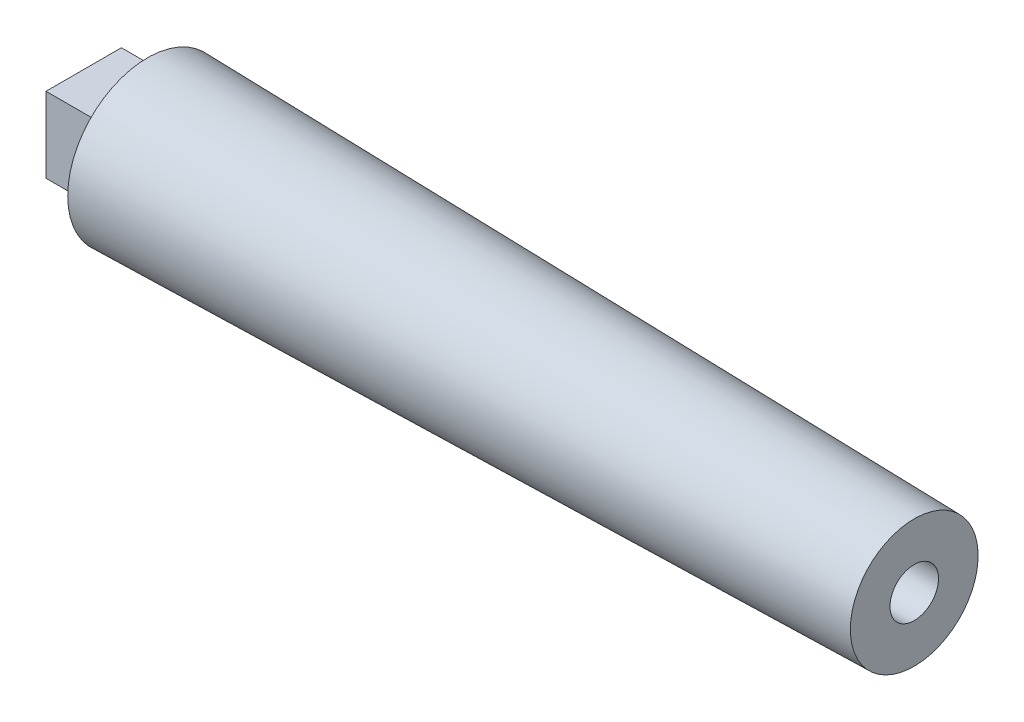
ISO-10303-21;
HEADER;
FILE_DESCRIPTION(('STEP AP214'),'2;1');
FILE_NAME('part.step','',(''),(''),'','','');
FILE_SCHEMA(('AUTOMOTIVE_DESIGN { 1 0 10303 214 1 1 1 1 }'));
ENDSEC;
DATA;
#1=APPLICATION_CONTEXT('core data for automotive mechanical design processes');
#2=APPLICATION_PROTOCOL_DEFINITION('international standard','automotive_design',2000,#1);
#3=PRODUCT_CONTEXT('',#1,'mechanical');
#4=PRODUCT('Part','Part','',(#3));
#5=PRODUCT_RELATED_PRODUCT_CATEGORY('part','',(#4));
#6=PRODUCT_DEFINITION_FORMATION('','',#4);
#7=PRODUCT_DEFINITION_CONTEXT('part definition',#1,'design');
#8=PRODUCT_DEFINITION('design','',#6,#7);
#9=PRODUCT_DEFINITION_SHAPE('','',#8);
#10=(LENGTH_UNIT() NAMED_UNIT(*) SI_UNIT(.MILLI.,.METRE.));
#11=(NAMED_UNIT(*) PLANE_ANGLE_UNIT() SI_UNIT($,.RADIAN.));
#12=(NAMED_UNIT(*) SI_UNIT($,.STERADIAN.) SOLID_ANGLE_UNIT());
#13=UNCERTAINTY_MEASURE_WITH_UNIT(LENGTH_MEASURE(1.E-05),#10,'distance_accuracy_value','');
#14=(GEOMETRIC_REPRESENTATION_CONTEXT(3) GLOBAL_UNCERTAINTY_ASSIGNED_CONTEXT((#13)) GLOBAL_UNIT_ASSIGNED_CONTEXT((#10,
#11,#12)) REPRESENTATION_CONTEXT('',''));
#15=CARTESIAN_POINT('',(0.,0.,0.));
#16=DIRECTION('',(0.,0.,1.));
#17=DIRECTION('',(1.,0.,0.));
#18=AXIS2_PLACEMENT_3D('',#15,#16,#17);
#19=CARTESIAN_POINT('',(0.,15.875,0.));
#20=DIRECTION('',(1.,0.,0.));
#21=DIRECTION('',(0.,0.,-1.));
#22=AXIS2_PLACEMENT_3D('',#19,#20,#21);
#23=PLANE('',#22);
#24=CARTESIAN_POINT('',(0.,0.,0.));
#25=DIRECTION('',(-1.,0.,0.));
#26=DIRECTION('',(0.,0.,1.));
#27=AXIS2_PLACEMENT_3D('',#24,#25,#26);
#28=CIRCLE('',#27,15.875);
#29=CARTESIAN_POINT('',(0.,0.,15.875));
#30=VERTEX_POINT('',#29);
#31=EDGE_CURVE('E47',#30,#30,#28,.T.);
#32=ORIENTED_EDGE('',*,*,#31,.T.);
#33=EDGE_LOOP('',(#32));
#34=FACE_BOUND('',#33,.T.);
#35=DIRECTION('',(0.,1.,0.));
#36=VECTOR('',#35,1.);
#37=CARTESIAN_POINT('',(0.,-7.493,7.493));
#38=LINE('',#37,#36);
#39=CARTESIAN_POINT('',(0.,-7.493,7.493));
#40=VERTEX_POINT('',#39);
#41=CARTESIAN_POINT('',(0.,7.493,7.493));
#42=VERTEX_POINT('',#41);
#43=EDGE_CURVE('E54',#40,#42,#38,.T.);
#44=ORIENTED_EDGE('',*,*,#43,.F.);
#45=DIRECTION('',(0.,0.,1.));
#46=VECTOR('',#45,1.);
#47=CARTESIAN_POINT('',(0.,-7.493,-7.493));
#48=LINE('',#47,#46);
#49=CARTESIAN_POINT('',(0.,-7.493,-7.493));
#50=VERTEX_POINT('',#49);
#51=EDGE_CURVE('E58',#50,#40,#48,.T.);
#52=ORIENTED_EDGE('',*,*,#51,.F.);
#53=DIRECTION('',(0.,-1.,0.));
#54=VECTOR('',#53,1.);
#55=CARTESIAN_POINT('',(0.,-7.493,-7.493));
#56=LINE('',#55,#54);
#57=CARTESIAN_POINT('',(0.,7.493,-7.493));
#58=VERTEX_POINT('',#57);
#59=EDGE_CURVE('E218',#58,#50,#56,.T.);
#60=ORIENTED_EDGE('',*,*,#59,.F.);
#61=DIRECTION('',(0.,0.,-1.));
#62=VECTOR('',#61,1.);
#63=CARTESIAN_POINT('',(0.,7.493,-7.493));
#64=LINE('',#63,#62);
#65=EDGE_CURVE('E228',#42,#58,#64,.T.);
#66=ORIENTED_EDGE('',*,*,#65,.F.);
#67=EDGE_LOOP('',(#44,#52,#60,#66));
#68=FACE_BOUND('',#67,.T.);
#69=ADVANCED_FACE('F39',(#34,#68),#23,.F.);
#70=CARTESIAN_POINT('',(152.4,0.,0.));
#71=DIRECTION('',(-1.,0.,0.));
#72=DIRECTION('',(0.,0.,1.));
#73=AXIS2_PLACEMENT_3D('',#70,#71,#72);
#74=PLANE('',#73);
#75=CARTESIAN_POINT('',(152.4,0.,0.));
#76=DIRECTION('',(1.,0.,0.));
#77=DIRECTION('',(0.,0.,-1.));
#78=AXIS2_PLACEMENT_3D('',#75,#76,#77);
#79=CIRCLE('',#78,4.826);
#80=CARTESIAN_POINT('',(152.4,0.,-4.826));
#81=VERTEX_POINT('',#80);
#82=EDGE_CURVE('E103',#81,#81,#79,.T.);
#83=ORIENTED_EDGE('',*,*,#82,.F.);
#84=EDGE_LOOP('',(#83));
#85=FACE_BOUND('',#84,.T.);
#86=CARTESIAN_POINT('',(152.4,0.,0.));
#87=DIRECTION('',(-1.,0.,0.));
#88=DIRECTION('',(0.,0.,1.));
#89=AXIS2_PLACEMENT_3D('',#86,#87,#88);
#90=CIRCLE('',#89,12.7);
#91=CARTESIAN_POINT('',(152.4,0.,12.7));
#92=VERTEX_POINT('',#91);
#93=EDGE_CURVE('E11',#92,#92,#90,.T.);
#94=ORIENTED_EDGE('',*,*,#93,.F.);
#95=EDGE_LOOP('',(#94));
#96=FACE_BOUND('',#95,.T.);
#97=ADVANCED_FACE('F125',(#85,#96),#74,.F.);
#98=CARTESIAN_POINT('',(152.4,0.,0.));
#99=DIRECTION('',(-1.,0.,0.));
#100=DIRECTION('',(0.,0.,1.));
#101=AXIS2_PLACEMENT_3D('',#98,#99,#100);
#102=CONICAL_SURFACE('',#101,12.7,0.0208303200362171);
#103=ORIENTED_EDGE('',*,*,#31,.F.);
#104=EDGE_LOOP('',(#103));
#105=FACE_BOUND('',#104,.T.);
#106=ORIENTED_EDGE('',*,*,#93,.T.);
#107=EDGE_LOOP('',(#106));
#108=FACE_BOUND('',#107,.T.);
#109=ADVANCED_FACE('F121',(#105,#108),#102,.T.);
#110=CARTESIAN_POINT('',(127.,0.,0.));
#111=DIRECTION('',(1.,0.,0.));
#112=DIRECTION('',(0.,0.,-1.));
#113=AXIS2_PLACEMENT_3D('',#110,#111,#112);
#114=CYLINDRICAL_SURFACE('',#113,4.826);
#115=CARTESIAN_POINT('',(127.,0.,0.));
#116=DIRECTION('',(1.,0.,0.));
#117=DIRECTION('',(0.,0.,-1.));
#118=AXIS2_PLACEMENT_3D('',#115,#116,#117);
#119=CIRCLE('',#118,4.826);
#120=CARTESIAN_POINT('',(127.,0.,-4.826));
#121=VERTEX_POINT('',#120);
#122=EDGE_CURVE('E108',#121,#121,#119,.T.);
#123=ORIENTED_EDGE('',*,*,#122,.F.);
#124=EDGE_LOOP('',(#123));
#125=FACE_BOUND('',#124,.T.);
#126=ORIENTED_EDGE('',*,*,#82,.T.);
#127=EDGE_LOOP('',(#126));
#128=FACE_BOUND('',#127,.T.);
#129=ADVANCED_FACE('F124',(#125,#128),#114,.F.);
#130=CARTESIAN_POINT('',(127.,0.,0.));
#131=DIRECTION('',(1.,0.,0.));
#132=DIRECTION('',(0.,0.,-1.));
#133=AXIS2_PLACEMENT_3D('',#130,#131,#132);
#134=PLANE('',#133);
#135=ORIENTED_EDGE('',*,*,#122,.T.);
#136=EDGE_LOOP('',(#135));
#137=FACE_BOUND('',#136,.T.);
#138=ADVANCED_FACE('F138',(#137),#134,.T.);
#139=CARTESIAN_POINT('',(-12.7,-7.493,7.493));
#140=DIRECTION('',(0.,0.,-1.));
#141=DIRECTION('',(-1.,0.,0.));
#142=AXIS2_PLACEMENT_3D('',#139,#140,#141);
#143=PLANE('',#142);
#144=ORIENTED_EDGE('',*,*,#43,.T.);
#145=DIRECTION('',(1.,0.,0.));
#146=VECTOR('',#145,1.);
#147=CARTESIAN_POINT('',(-12.7,7.493,7.493));
#148=LINE('',#147,#146);
#149=CARTESIAN_POINT('',(-12.7,7.493,7.493));
#150=VERTEX_POINT('',#149);
#151=EDGE_CURVE('E83',#150,#42,#148,.T.);
#152=ORIENTED_EDGE('',*,*,#151,.F.);
#153=DIRECTION('',(0.,1.,0.));
#154=VECTOR('',#153,1.);
#155=CARTESIAN_POINT('',(-12.7,-7.493,7.493));
#156=LINE('',#155,#154);
#157=CARTESIAN_POINT('',(-12.7,-7.493,7.493));
#158=VERTEX_POINT('',#157);
#159=EDGE_CURVE('E90',#158,#150,#156,.T.);
#160=ORIENTED_EDGE('',*,*,#159,.F.);
#161=DIRECTION('',(1.,0.,0.));
#162=VECTOR('',#161,1.);
#163=CARTESIAN_POINT('',(-12.7,-7.493,7.493));
#164=LINE('',#163,#162);
#165=EDGE_CURVE('E215',#158,#40,#164,.T.);
#166=ORIENTED_EDGE('',*,*,#165,.T.);
#167=EDGE_LOOP('',(#144,#152,#160,#166));
#168=FACE_BOUND('',#167,.T.);
#169=ADVANCED_FACE('F101',(#168),#143,.F.);
#170=CARTESIAN_POINT('',(-12.7,7.493,-7.493));
#171=DIRECTION('',(0.,-1.,0.));
#172=DIRECTION('',(0.,0.,-1.));
#173=AXIS2_PLACEMENT_3D('',#170,#171,#172);
#174=PLANE('',#173);
#175=ORIENTED_EDGE('',*,*,#65,.T.);
#176=DIRECTION('',(1.,0.,0.));
#177=VECTOR('',#176,1.);
#178=CARTESIAN_POINT('',(-12.7,7.493,-7.493));
#179=LINE('',#178,#177);
#180=CARTESIAN_POINT('',(-12.7,7.493,-7.493));
#181=VERTEX_POINT('',#180);
#182=EDGE_CURVE('E85',#181,#58,#179,.T.);
#183=ORIENTED_EDGE('',*,*,#182,.F.);
#184=DIRECTION('',(0.,0.,-1.));
#185=VECTOR('',#184,1.);
#186=CARTESIAN_POINT('',(-12.7,7.493,-7.493));
#187=LINE('',#186,#185);
#188=EDGE_CURVE('E78',#150,#181,#187,.T.);
#189=ORIENTED_EDGE('',*,*,#188,.F.);
#190=ORIENTED_EDGE('',*,*,#151,.T.);
#191=EDGE_LOOP('',(#175,#183,#189,#190));
#192=FACE_BOUND('',#191,.T.);
#193=ADVANCED_FACE('F81',(#192),#174,.F.);
#194=CARTESIAN_POINT('',(-12.7,-7.493,-7.493));
#195=DIRECTION('',(0.,0.,1.));
#196=DIRECTION('',(1.,0.,0.));
#197=AXIS2_PLACEMENT_3D('',#194,#195,#196);
#198=PLANE('',#197);
#199=ORIENTED_EDGE('',*,*,#59,.T.);
#200=DIRECTION('',(1.,0.,0.));
#201=VECTOR('',#200,1.);
#202=CARTESIAN_POINT('',(-12.7,-7.493,-7.493));
#203=LINE('',#202,#201);
#204=CARTESIAN_POINT('',(-12.7,-7.493,-7.493));
#205=VERTEX_POINT('',#204);
#206=EDGE_CURVE('E110',#205,#50,#203,.T.);
#207=ORIENTED_EDGE('',*,*,#206,.F.);
#208=DIRECTION('',(0.,-1.,0.));
#209=VECTOR('',#208,1.);
#210=CARTESIAN_POINT('',(-12.7,-7.493,-7.493));
#211=LINE('',#210,#209);
#212=EDGE_CURVE('E89',#181,#205,#211,.T.);
#213=ORIENTED_EDGE('',*,*,#212,.F.);
#214=ORIENTED_EDGE('',*,*,#182,.T.);
#215=EDGE_LOOP('',(#199,#207,#213,#214));
#216=FACE_BOUND('',#215,.T.);
#217=ADVANCED_FACE('F147',(#216),#198,.F.);
#218=CARTESIAN_POINT('',(-12.7,-7.493,-7.493));
#219=DIRECTION('',(0.,1.,0.));
#220=DIRECTION('',(0.,0.,1.));
#221=AXIS2_PLACEMENT_3D('',#218,#219,#220);
#222=PLANE('',#221);
#223=ORIENTED_EDGE('',*,*,#51,.T.);
#224=ORIENTED_EDGE('',*,*,#165,.F.);
#225=DIRECTION('',(0.,0.,1.));
#226=VECTOR('',#225,1.);
#227=CARTESIAN_POINT('',(-12.7,-7.493,-7.493));
#228=LINE('',#227,#226);
#229=EDGE_CURVE('E95',#205,#158,#228,.T.);
#230=ORIENTED_EDGE('',*,*,#229,.F.);
#231=ORIENTED_EDGE('',*,*,#206,.T.);
#232=EDGE_LOOP('',(#223,#224,#230,#231));
#233=FACE_BOUND('',#232,.T.);
#234=ADVANCED_FACE('F150',(#233),#222,.F.);
#235=CARTESIAN_POINT('',(-12.7,0.,0.));
#236=DIRECTION('',(1.,0.,0.));
#237=DIRECTION('',(0.,0.,-1.));
#238=AXIS2_PLACEMENT_3D('',#235,#236,#237);
#239=PLANE('',#238);
#240=ORIENTED_EDGE('',*,*,#159,.T.);
#241=ORIENTED_EDGE('',*,*,#188,.T.);
#242=ORIENTED_EDGE('',*,*,#212,.T.);
#243=ORIENTED_EDGE('',*,*,#229,.T.);
#244=EDGE_LOOP('',(#240,#241,#242,#243));
#245=FACE_BOUND('',#244,.T.);
#246=ADVANCED_FACE('F93',(#245),#239,.F.);
#247=CLOSED_SHELL('',(#69,#97,#109,#129,#138,#169,#193,#217,#234,#246));
#248=MANIFOLD_SOLID_BREP('B2',#247);
#249=ADVANCED_BREP_SHAPE_REPRESENTATION('',(#18,#248),#14);
#250=SHAPE_DEFINITION_REPRESENTATION(#9,#249);
ENDSEC;
END-ISO-10303-21;
